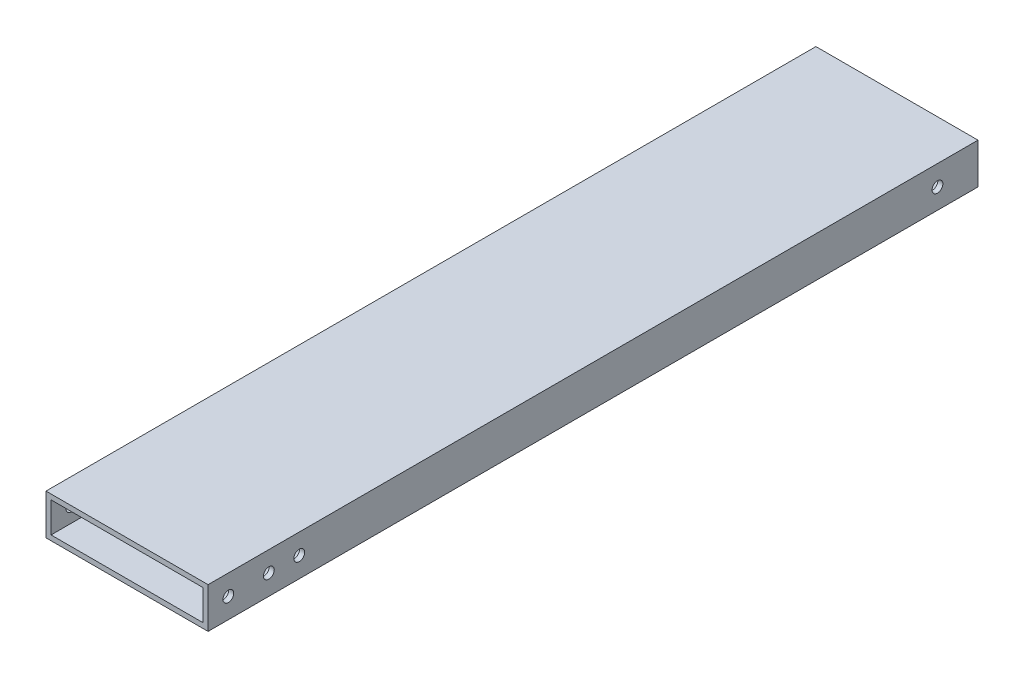
ISO-10303-21;
HEADER;
FILE_DESCRIPTION(('STEP AP214'),'2;1');
FILE_NAME('part.step','',(''),(''),'','','');
FILE_SCHEMA(('AUTOMOTIVE_DESIGN { 1 0 10303 214 1 1 1 1 }'));
ENDSEC;
DATA;
#1=APPLICATION_CONTEXT('core data for automotive mechanical design processes');
#2=APPLICATION_PROTOCOL_DEFINITION('international standard','automotive_design',2000,#1);
#3=PRODUCT_CONTEXT('',#1,'mechanical');
#4=PRODUCT('Part','Part','',(#3));
#5=PRODUCT_RELATED_PRODUCT_CATEGORY('part','',(#4));
#6=PRODUCT_DEFINITION_FORMATION('','',#4);
#7=PRODUCT_DEFINITION_CONTEXT('part definition',#1,'design');
#8=PRODUCT_DEFINITION('design','',#6,#7);
#9=PRODUCT_DEFINITION_SHAPE('','',#8);
#10=(LENGTH_UNIT() NAMED_UNIT(*) SI_UNIT(.MILLI.,.METRE.));
#11=(NAMED_UNIT(*) PLANE_ANGLE_UNIT() SI_UNIT($,.RADIAN.));
#12=(NAMED_UNIT(*) SI_UNIT($,.STERADIAN.) SOLID_ANGLE_UNIT());
#13=UNCERTAINTY_MEASURE_WITH_UNIT(LENGTH_MEASURE(1.E-05),#10,'distance_accuracy_value','');
#14=(GEOMETRIC_REPRESENTATION_CONTEXT(3) GLOBAL_UNCERTAINTY_ASSIGNED_CONTEXT((#13)) GLOBAL_UNIT_ASSIGNED_CONTEXT((#10,
#11,#12)) REPRESENTATION_CONTEXT('',''));
#15=CARTESIAN_POINT('',(0.,0.,0.));
#16=DIRECTION('',(0.,0.,1.));
#17=DIRECTION('',(1.,0.,0.));
#18=AXIS2_PLACEMENT_3D('',#15,#16,#17);
#19=CARTESIAN_POINT('',(0.,0.,482.6));
#20=DIRECTION('',(0.,0.,-1.));
#21=DIRECTION('',(-1.,0.,0.));
#22=AXIS2_PLACEMENT_3D('',#19,#20,#21);
#23=PLANE('',#22);
#24=DIRECTION('',(0.,-1.,0.));
#25=VECTOR('',#24,1.);
#26=CARTESIAN_POINT('',(-50.8,-12.7,482.6));
#27=LINE('',#26,#25);
#28=CARTESIAN_POINT('',(-50.8,12.7,482.6));
#29=VERTEX_POINT('',#28);
#30=CARTESIAN_POINT('',(-50.8,-12.7,482.6));
#31=VERTEX_POINT('',#30);
#32=EDGE_CURVE('E139',#29,#31,#27,.T.);
#33=ORIENTED_EDGE('',*,*,#32,.T.);
#34=DIRECTION('',(1.,0.,0.));
#35=VECTOR('',#34,1.);
#36=CARTESIAN_POINT('',(-50.8,-12.7,482.6));
#37=LINE('',#36,#35);
#38=CARTESIAN_POINT('',(50.8,-12.7,482.6));
#39=VERTEX_POINT('',#38);
#40=EDGE_CURVE('E142',#31,#39,#37,.T.);
#41=ORIENTED_EDGE('',*,*,#40,.T.);
#42=DIRECTION('',(0.,1.,0.));
#43=VECTOR('',#42,1.);
#44=CARTESIAN_POINT('',(50.8,-12.7,482.6));
#45=LINE('',#44,#43);
#46=CARTESIAN_POINT('',(50.8,12.7,482.6));
#47=VERTEX_POINT('',#46);
#48=EDGE_CURVE('E145',#39,#47,#45,.T.);
#49=ORIENTED_EDGE('',*,*,#48,.T.);
#50=DIRECTION('',(-1.,0.,0.));
#51=VECTOR('',#50,1.);
#52=CARTESIAN_POINT('',(-50.8,12.7,482.6));
#53=LINE('',#52,#51);
#54=EDGE_CURVE('E147',#47,#29,#53,.T.);
#55=ORIENTED_EDGE('',*,*,#54,.T.);
#56=EDGE_LOOP('',(#33,#41,#49,#55));
#57=FACE_BOUND('',#56,.T.);
#58=DIRECTION('',(0.,1.,0.));
#59=VECTOR('',#58,1.);
#60=CARTESIAN_POINT('',(47.625,-9.525,482.6));
#61=LINE('',#60,#59);
#62=CARTESIAN_POINT('',(47.625,-9.525,482.6));
#63=VERTEX_POINT('',#62);
#64=CARTESIAN_POINT('',(47.625,9.525,482.6));
#65=VERTEX_POINT('',#64);
#66=EDGE_CURVE('E101',#63,#65,#61,.T.);
#67=ORIENTED_EDGE('',*,*,#66,.F.);
#68=DIRECTION('',(1.,0.,0.));
#69=VECTOR('',#68,1.);
#70=CARTESIAN_POINT('',(-47.625,-9.525,482.6));
#71=LINE('',#70,#69);
#72=CARTESIAN_POINT('',(-47.625,-9.525,482.6));
#73=VERTEX_POINT('',#72);
#74=EDGE_CURVE('E123',#73,#63,#71,.T.);
#75=ORIENTED_EDGE('',*,*,#74,.F.);
#76=DIRECTION('',(0.,-1.,0.));
#77=VECTOR('',#76,1.);
#78=CARTESIAN_POINT('',(-47.625,-9.525,482.6));
#79=LINE('',#78,#77);
#80=CARTESIAN_POINT('',(-47.625,9.525,482.6));
#81=VERTEX_POINT('',#80);
#82=EDGE_CURVE('E121',#81,#73,#79,.T.);
#83=ORIENTED_EDGE('',*,*,#82,.F.);
#84=DIRECTION('',(-1.,0.,0.));
#85=VECTOR('',#84,1.);
#86=CARTESIAN_POINT('',(-47.625,9.525,482.6));
#87=LINE('',#86,#85);
#88=EDGE_CURVE('E109',#65,#81,#87,.T.);
#89=ORIENTED_EDGE('',*,*,#88,.F.);
#90=EDGE_LOOP('',(#67,#75,#83,#89));
#91=FACE_BOUND('',#90,.T.);
#92=ADVANCED_FACE('F34',(#57,#91),#23,.F.);
#93=CARTESIAN_POINT('',(0.,0.,0.));
#94=DIRECTION('',(0.,0.,-1.));
#95=DIRECTION('',(-1.,0.,0.));
#96=AXIS2_PLACEMENT_3D('',#93,#94,#95);
#97=PLANE('',#96);
#98=DIRECTION('',(0.,-1.,0.));
#99=VECTOR('',#98,1.);
#100=CARTESIAN_POINT('',(-50.8,-12.7,0.));
#101=LINE('',#100,#99);
#102=CARTESIAN_POINT('',(-50.8,12.7,0.));
#103=VERTEX_POINT('',#102);
#104=CARTESIAN_POINT('',(-50.8,-12.7,0.));
#105=VERTEX_POINT('',#104);
#106=EDGE_CURVE('E117',#103,#105,#101,.T.);
#107=ORIENTED_EDGE('',*,*,#106,.F.);
#108=DIRECTION('',(-1.,0.,0.));
#109=VECTOR('',#108,1.);
#110=CARTESIAN_POINT('',(-50.8,12.7,0.));
#111=LINE('',#110,#109);
#112=CARTESIAN_POINT('',(50.8,12.7,0.));
#113=VERTEX_POINT('',#112);
#114=EDGE_CURVE('E143',#113,#103,#111,.T.);
#115=ORIENTED_EDGE('',*,*,#114,.F.);
#116=DIRECTION('',(0.,1.,0.));
#117=VECTOR('',#116,1.);
#118=CARTESIAN_POINT('',(50.8,-12.7,0.));
#119=LINE('',#118,#117);
#120=CARTESIAN_POINT('',(50.8,-12.7,0.));
#121=VERTEX_POINT('',#120);
#122=EDGE_CURVE('E154',#121,#113,#119,.T.);
#123=ORIENTED_EDGE('',*,*,#122,.F.);
#124=DIRECTION('',(1.,0.,0.));
#125=VECTOR('',#124,1.);
#126=CARTESIAN_POINT('',(-50.8,-12.7,0.));
#127=LINE('',#126,#125);
#128=EDGE_CURVE('E152',#105,#121,#127,.T.);
#129=ORIENTED_EDGE('',*,*,#128,.F.);
#130=EDGE_LOOP('',(#107,#115,#123,#129));
#131=FACE_BOUND('',#130,.T.);
#132=DIRECTION('',(1.,0.,0.));
#133=VECTOR('',#132,1.);
#134=CARTESIAN_POINT('',(-47.625,-9.525,0.));
#135=LINE('',#134,#133);
#136=CARTESIAN_POINT('',(-47.625,-9.525,0.));
#137=VERTEX_POINT('',#136);
#138=CARTESIAN_POINT('',(47.625,-9.525,0.));
#139=VERTEX_POINT('',#138);
#140=EDGE_CURVE('E110',#137,#139,#135,.T.);
#141=ORIENTED_EDGE('',*,*,#140,.T.);
#142=DIRECTION('',(0.,1.,0.));
#143=VECTOR('',#142,1.);
#144=CARTESIAN_POINT('',(47.625,-9.525,0.));
#145=LINE('',#144,#143);
#146=CARTESIAN_POINT('',(47.625,9.525,0.));
#147=VERTEX_POINT('',#146);
#148=EDGE_CURVE('E59',#139,#147,#145,.T.);
#149=ORIENTED_EDGE('',*,*,#148,.T.);
#150=DIRECTION('',(-1.,0.,0.));
#151=VECTOR('',#150,1.);
#152=CARTESIAN_POINT('',(-47.625,9.525,0.));
#153=LINE('',#152,#151);
#154=CARTESIAN_POINT('',(-47.625,9.525,0.));
#155=VERTEX_POINT('',#154);
#156=EDGE_CURVE('E116',#147,#155,#153,.T.);
#157=ORIENTED_EDGE('',*,*,#156,.T.);
#158=DIRECTION('',(0.,-1.,0.));
#159=VECTOR('',#158,1.);
#160=CARTESIAN_POINT('',(-47.625,-9.525,0.));
#161=LINE('',#160,#159);
#162=EDGE_CURVE('E131',#155,#137,#161,.T.);
#163=ORIENTED_EDGE('',*,*,#162,.T.);
#164=EDGE_LOOP('',(#141,#149,#157,#163));
#165=FACE_BOUND('',#164,.T.);
#166=ADVANCED_FACE('F224',(#131,#165),#97,.T.);
#167=CARTESIAN_POINT('',(-50.8,-12.7,482.6));
#168=DIRECTION('',(1.,0.,0.));
#169=DIRECTION('',(0.,0.,-1.));
#170=AXIS2_PLACEMENT_3D('',#167,#168,#169);
#171=PLANE('',#170);
#172=CARTESIAN_POINT('',(-50.8,0.,25.4));
#173=DIRECTION('',(1.,0.,0.));
#174=DIRECTION('',(0.,0.,-1.));
#175=AXIS2_PLACEMENT_3D('',#172,#173,#174);
#176=CIRCLE('',#175,3.37819999999999);
#177=CARTESIAN_POINT('',(-50.8,0.,22.0218));
#178=VERTEX_POINT('',#177);
#179=EDGE_CURVE('E292',#178,#178,#176,.T.);
#180=ORIENTED_EDGE('',*,*,#179,.T.);
#181=EDGE_LOOP('',(#180));
#182=FACE_BOUND('',#181,.T.);
#183=CARTESIAN_POINT('',(-50.8,0.,469.9));
#184=DIRECTION('',(1.,0.,0.));
#185=DIRECTION('',(0.,0.,-1.));
#186=AXIS2_PLACEMENT_3D('',#183,#184,#185);
#187=CIRCLE('',#186,3.37819999999999);
#188=CARTESIAN_POINT('',(-50.8,0.,466.5218));
#189=VERTEX_POINT('',#188);
#190=EDGE_CURVE('E175',#189,#189,#187,.T.);
#191=ORIENTED_EDGE('',*,*,#190,.T.);
#192=EDGE_LOOP('',(#191));
#193=FACE_BOUND('',#192,.T.);
#194=CARTESIAN_POINT('',(-50.8,0.,444.5));
#195=DIRECTION('',(1.,0.,0.));
#196=DIRECTION('',(0.,0.,-1.));
#197=AXIS2_PLACEMENT_3D('',#194,#195,#196);
#198=CIRCLE('',#197,3.37819999999999);
#199=CARTESIAN_POINT('',(-50.8,0.,441.1218));
#200=VERTEX_POINT('',#199);
#201=EDGE_CURVE('E171',#200,#200,#198,.T.);
#202=ORIENTED_EDGE('',*,*,#201,.T.);
#203=EDGE_LOOP('',(#202));
#204=FACE_BOUND('',#203,.T.);
#205=CARTESIAN_POINT('',(-50.8,0.,425.45));
#206=DIRECTION('',(1.,0.,0.));
#207=DIRECTION('',(0.,0.,-1.));
#208=AXIS2_PLACEMENT_3D('',#205,#206,#207);
#209=CIRCLE('',#208,3.37819999999999);
#210=CARTESIAN_POINT('',(-50.8,0.,422.0718));
#211=VERTEX_POINT('',#210);
#212=EDGE_CURVE('E167',#211,#211,#209,.T.);
#213=ORIENTED_EDGE('',*,*,#212,.T.);
#214=EDGE_LOOP('',(#213));
#215=FACE_BOUND('',#214,.T.);
#216=ORIENTED_EDGE('',*,*,#106,.T.);
#217=DIRECTION('',(0.,0.,-1.));
#218=VECTOR('',#217,1.);
#219=CARTESIAN_POINT('',(-50.8,-12.7,482.6));
#220=LINE('',#219,#218);
#221=EDGE_CURVE('E11',#31,#105,#220,.T.);
#222=ORIENTED_EDGE('',*,*,#221,.F.);
#223=ORIENTED_EDGE('',*,*,#32,.F.);
#224=DIRECTION('',(0.,0.,-1.));
#225=VECTOR('',#224,1.);
#226=CARTESIAN_POINT('',(-50.8,12.7,482.6));
#227=LINE('',#226,#225);
#228=EDGE_CURVE('E149',#29,#103,#227,.T.);
#229=ORIENTED_EDGE('',*,*,#228,.T.);
#230=EDGE_LOOP('',(#216,#222,#223,#229));
#231=FACE_BOUND('',#230,.T.);
#232=ADVANCED_FACE('F36',(#182,#193,#204,#215,#231),#171,.F.);
#233=CARTESIAN_POINT('',(-50.8,-12.7,482.6));
#234=DIRECTION('',(0.,1.,0.));
#235=DIRECTION('',(0.,0.,1.));
#236=AXIS2_PLACEMENT_3D('',#233,#234,#235);
#237=PLANE('',#236);
#238=ORIENTED_EDGE('',*,*,#128,.T.);
#239=DIRECTION('',(0.,0.,-1.));
#240=VECTOR('',#239,1.);
#241=CARTESIAN_POINT('',(50.8,-12.7,482.6));
#242=LINE('',#241,#240);
#243=EDGE_CURVE('E43',#39,#121,#242,.T.);
#244=ORIENTED_EDGE('',*,*,#243,.F.);
#245=ORIENTED_EDGE('',*,*,#40,.F.);
#246=ORIENTED_EDGE('',*,*,#221,.T.);
#247=EDGE_LOOP('',(#238,#244,#245,#246));
#248=FACE_BOUND('',#247,.T.);
#249=ADVANCED_FACE('F233',(#248),#237,.F.);
#250=CARTESIAN_POINT('',(50.8,-12.7,482.6));
#251=DIRECTION('',(-1.,0.,0.));
#252=DIRECTION('',(0.,0.,1.));
#253=AXIS2_PLACEMENT_3D('',#250,#251,#252);
#254=PLANE('',#253);
#255=CARTESIAN_POINT('',(50.8,0.,25.4));
#256=DIRECTION('',(1.,0.,0.));
#257=DIRECTION('',(0.,0.,-1.));
#258=AXIS2_PLACEMENT_3D('',#255,#256,#257);
#259=CIRCLE('',#258,3.37819999999999);
#260=CARTESIAN_POINT('',(50.8,0.,22.0218));
#261=VERTEX_POINT('',#260);
#262=EDGE_CURVE('E291',#261,#261,#259,.T.);
#263=ORIENTED_EDGE('',*,*,#262,.F.);
#264=EDGE_LOOP('',(#263));
#265=FACE_BOUND('',#264,.T.);
#266=CARTESIAN_POINT('',(50.8,0.,469.9));
#267=DIRECTION('',(1.,0.,0.));
#268=DIRECTION('',(0.,0.,-1.));
#269=AXIS2_PLACEMENT_3D('',#266,#267,#268);
#270=CIRCLE('',#269,3.37819999999999);
#271=CARTESIAN_POINT('',(50.8,0.,466.5218));
#272=VERTEX_POINT('',#271);
#273=EDGE_CURVE('E182',#272,#272,#270,.T.);
#274=ORIENTED_EDGE('',*,*,#273,.F.);
#275=EDGE_LOOP('',(#274));
#276=FACE_BOUND('',#275,.T.);
#277=CARTESIAN_POINT('',(50.8,0.,444.5));
#278=DIRECTION('',(1.,0.,0.));
#279=DIRECTION('',(0.,0.,-1.));
#280=AXIS2_PLACEMENT_3D('',#277,#278,#279);
#281=CIRCLE('',#280,3.37819999999999);
#282=CARTESIAN_POINT('',(50.8,0.,441.1218));
#283=VERTEX_POINT('',#282);
#284=EDGE_CURVE('E179',#283,#283,#281,.T.);
#285=ORIENTED_EDGE('',*,*,#284,.F.);
#286=EDGE_LOOP('',(#285));
#287=FACE_BOUND('',#286,.T.);
#288=CARTESIAN_POINT('',(50.8,0.,425.45));
#289=DIRECTION('',(1.,0.,0.));
#290=DIRECTION('',(0.,0.,-1.));
#291=AXIS2_PLACEMENT_3D('',#288,#289,#290);
#292=CIRCLE('',#291,3.37819999999999);
#293=CARTESIAN_POINT('',(50.8,0.,422.0718));
#294=VERTEX_POINT('',#293);
#295=EDGE_CURVE('E197',#294,#294,#292,.T.);
#296=ORIENTED_EDGE('',*,*,#295,.F.);
#297=EDGE_LOOP('',(#296));
#298=FACE_BOUND('',#297,.T.);
#299=ORIENTED_EDGE('',*,*,#122,.T.);
#300=DIRECTION('',(0.,0.,-1.));
#301=VECTOR('',#300,1.);
#302=CARTESIAN_POINT('',(50.8,12.7,482.6));
#303=LINE('',#302,#301);
#304=EDGE_CURVE('E159',#47,#113,#303,.T.);
#305=ORIENTED_EDGE('',*,*,#304,.F.);
#306=ORIENTED_EDGE('',*,*,#48,.F.);
#307=ORIENTED_EDGE('',*,*,#243,.T.);
#308=EDGE_LOOP('',(#299,#305,#306,#307));
#309=FACE_BOUND('',#308,.T.);
#310=ADVANCED_FACE('F217',(#265,#276,#287,#298,#309),#254,.F.);
#311=CARTESIAN_POINT('',(-50.8,12.7,482.6));
#312=DIRECTION('',(0.,-1.,0.));
#313=DIRECTION('',(0.,0.,-1.));
#314=AXIS2_PLACEMENT_3D('',#311,#312,#313);
#315=PLANE('',#314);
#316=ORIENTED_EDGE('',*,*,#114,.T.);
#317=ORIENTED_EDGE('',*,*,#228,.F.);
#318=ORIENTED_EDGE('',*,*,#54,.F.);
#319=ORIENTED_EDGE('',*,*,#304,.T.);
#320=EDGE_LOOP('',(#316,#317,#318,#319));
#321=FACE_BOUND('',#320,.T.);
#322=ADVANCED_FACE('F208',(#321),#315,.F.);
#323=CARTESIAN_POINT('',(47.625,-9.525,482.6));
#324=DIRECTION('',(-1.,0.,0.));
#325=DIRECTION('',(0.,0.,1.));
#326=AXIS2_PLACEMENT_3D('',#323,#324,#325);
#327=PLANE('',#326);
#328=CARTESIAN_POINT('',(47.625,0.,25.4));
#329=DIRECTION('',(-1.,0.,0.));
#330=DIRECTION('',(0.,0.,1.));
#331=AXIS2_PLACEMENT_3D('',#328,#329,#330);
#332=CIRCLE('',#331,3.37819999999999);
#333=CARTESIAN_POINT('',(47.625,0.,28.7782));
#334=VERTEX_POINT('',#333);
#335=EDGE_CURVE('E38',#334,#334,#332,.T.);
#336=ORIENTED_EDGE('',*,*,#335,.F.);
#337=EDGE_LOOP('',(#336));
#338=FACE_BOUND('',#337,.T.);
#339=CARTESIAN_POINT('',(47.625,0.,469.9));
#340=DIRECTION('',(-1.,0.,0.));
#341=DIRECTION('',(0.,0.,1.));
#342=AXIS2_PLACEMENT_3D('',#339,#340,#341);
#343=CIRCLE('',#342,3.37819999999999);
#344=CARTESIAN_POINT('',(47.625,0.,473.2782));
#345=VERTEX_POINT('',#344);
#346=EDGE_CURVE('E174',#345,#345,#343,.T.);
#347=ORIENTED_EDGE('',*,*,#346,.F.);
#348=EDGE_LOOP('',(#347));
#349=FACE_BOUND('',#348,.T.);
#350=CARTESIAN_POINT('',(47.625,0.,444.5));
#351=DIRECTION('',(-1.,0.,0.));
#352=DIRECTION('',(0.,0.,1.));
#353=AXIS2_PLACEMENT_3D('',#350,#351,#352);
#354=CIRCLE('',#353,3.37819999999999);
#355=CARTESIAN_POINT('',(47.625,0.,447.8782));
#356=VERTEX_POINT('',#355);
#357=EDGE_CURVE('E170',#356,#356,#354,.T.);
#358=ORIENTED_EDGE('',*,*,#357,.F.);
#359=EDGE_LOOP('',(#358));
#360=FACE_BOUND('',#359,.T.);
#361=CARTESIAN_POINT('',(47.625,0.,425.45));
#362=DIRECTION('',(-1.,0.,0.));
#363=DIRECTION('',(0.,0.,1.));
#364=AXIS2_PLACEMENT_3D('',#361,#362,#363);
#365=CIRCLE('',#364,3.37819999999999);
#366=CARTESIAN_POINT('',(47.625,0.,428.8282));
#367=VERTEX_POINT('',#366);
#368=EDGE_CURVE('E129',#367,#367,#365,.T.);
#369=ORIENTED_EDGE('',*,*,#368,.F.);
#370=EDGE_LOOP('',(#369));
#371=FACE_BOUND('',#370,.T.);
#372=ORIENTED_EDGE('',*,*,#148,.F.);
#373=DIRECTION('',(0.,0.,-1.));
#374=VECTOR('',#373,1.);
#375=CARTESIAN_POINT('',(47.625,-9.525,482.6));
#376=LINE('',#375,#374);
#377=EDGE_CURVE('E105',#63,#139,#376,.T.);
#378=ORIENTED_EDGE('',*,*,#377,.F.);
#379=ORIENTED_EDGE('',*,*,#66,.T.);
#380=DIRECTION('',(0.,0.,-1.));
#381=VECTOR('',#380,1.);
#382=CARTESIAN_POINT('',(47.625,9.525,482.6));
#383=LINE('',#382,#381);
#384=EDGE_CURVE('E104',#65,#147,#383,.T.);
#385=ORIENTED_EDGE('',*,*,#384,.T.);
#386=EDGE_LOOP('',(#372,#378,#379,#385));
#387=FACE_BOUND('',#386,.T.);
#388=ADVANCED_FACE('F103',(#338,#349,#360,#371,#387),#327,.T.);
#389=CARTESIAN_POINT('',(-47.625,9.525,482.6));
#390=DIRECTION('',(0.,-1.,0.));
#391=DIRECTION('',(0.,0.,-1.));
#392=AXIS2_PLACEMENT_3D('',#389,#390,#391);
#393=PLANE('',#392);
#394=ORIENTED_EDGE('',*,*,#156,.F.);
#395=ORIENTED_EDGE('',*,*,#384,.F.);
#396=ORIENTED_EDGE('',*,*,#88,.T.);
#397=DIRECTION('',(0.,0.,-1.));
#398=VECTOR('',#397,1.);
#399=CARTESIAN_POINT('',(-47.625,9.525,482.6));
#400=LINE('',#399,#398);
#401=EDGE_CURVE('E118',#81,#155,#400,.T.);
#402=ORIENTED_EDGE('',*,*,#401,.T.);
#403=EDGE_LOOP('',(#394,#395,#396,#402));
#404=FACE_BOUND('',#403,.T.);
#405=ADVANCED_FACE('F113',(#404),#393,.T.);
#406=CARTESIAN_POINT('',(-47.625,-9.525,482.6));
#407=DIRECTION('',(1.,0.,0.));
#408=DIRECTION('',(0.,0.,-1.));
#409=AXIS2_PLACEMENT_3D('',#406,#407,#408);
#410=PLANE('',#409);
#411=CARTESIAN_POINT('',(-47.625,0.,25.4));
#412=DIRECTION('',(1.,0.,0.));
#413=DIRECTION('',(0.,0.,-1.));
#414=AXIS2_PLACEMENT_3D('',#411,#412,#413);
#415=CIRCLE('',#414,3.37819999999999);
#416=CARTESIAN_POINT('',(-47.625,0.,22.0218));
#417=VERTEX_POINT('',#416);
#418=EDGE_CURVE('E187',#417,#417,#415,.T.);
#419=ORIENTED_EDGE('',*,*,#418,.F.);
#420=EDGE_LOOP('',(#419));
#421=FACE_BOUND('',#420,.T.);
#422=CARTESIAN_POINT('',(-47.625,0.,469.9));
#423=DIRECTION('',(1.,0.,0.));
#424=DIRECTION('',(0.,0.,-1.));
#425=AXIS2_PLACEMENT_3D('',#422,#423,#424);
#426=CIRCLE('',#425,3.37819999999999);
#427=CARTESIAN_POINT('',(-47.625,0.,466.5218));
#428=VERTEX_POINT('',#427);
#429=EDGE_CURVE('E172',#428,#428,#426,.T.);
#430=ORIENTED_EDGE('',*,*,#429,.F.);
#431=EDGE_LOOP('',(#430));
#432=FACE_BOUND('',#431,.T.);
#433=CARTESIAN_POINT('',(-47.625,0.,444.5));
#434=DIRECTION('',(1.,0.,0.));
#435=DIRECTION('',(0.,0.,-1.));
#436=AXIS2_PLACEMENT_3D('',#433,#434,#435);
#437=CIRCLE('',#436,3.37819999999999);
#438=CARTESIAN_POINT('',(-47.625,0.,441.1218));
#439=VERTEX_POINT('',#438);
#440=EDGE_CURVE('E168',#439,#439,#437,.T.);
#441=ORIENTED_EDGE('',*,*,#440,.F.);
#442=EDGE_LOOP('',(#441));
#443=FACE_BOUND('',#442,.T.);
#444=CARTESIAN_POINT('',(-47.625,0.,425.45));
#445=DIRECTION('',(1.,0.,0.));
#446=DIRECTION('',(0.,0.,-1.));
#447=AXIS2_PLACEMENT_3D('',#444,#445,#446);
#448=CIRCLE('',#447,3.37819999999999);
#449=CARTESIAN_POINT('',(-47.625,0.,422.0718));
#450=VERTEX_POINT('',#449);
#451=EDGE_CURVE('E164',#450,#450,#448,.T.);
#452=ORIENTED_EDGE('',*,*,#451,.F.);
#453=EDGE_LOOP('',(#452));
#454=FACE_BOUND('',#453,.T.);
#455=ORIENTED_EDGE('',*,*,#162,.F.);
#456=ORIENTED_EDGE('',*,*,#401,.F.);
#457=ORIENTED_EDGE('',*,*,#82,.T.);
#458=DIRECTION('',(0.,0.,-1.));
#459=VECTOR('',#458,1.);
#460=CARTESIAN_POINT('',(-47.625,-9.525,482.6));
#461=LINE('',#460,#459);
#462=EDGE_CURVE('E51',#73,#137,#461,.T.);
#463=ORIENTED_EDGE('',*,*,#462,.T.);
#464=EDGE_LOOP('',(#455,#456,#457,#463));
#465=FACE_BOUND('',#464,.T.);
#466=ADVANCED_FACE('F215',(#421,#432,#443,#454,#465),#410,.T.);
#467=CARTESIAN_POINT('',(-47.625,-9.525,482.6));
#468=DIRECTION('',(0.,1.,0.));
#469=DIRECTION('',(0.,0.,1.));
#470=AXIS2_PLACEMENT_3D('',#467,#468,#469);
#471=PLANE('',#470);
#472=ORIENTED_EDGE('',*,*,#140,.F.);
#473=ORIENTED_EDGE('',*,*,#462,.F.);
#474=ORIENTED_EDGE('',*,*,#74,.T.);
#475=ORIENTED_EDGE('',*,*,#377,.T.);
#476=EDGE_LOOP('',(#472,#473,#474,#475));
#477=FACE_BOUND('',#476,.T.);
#478=ADVANCED_FACE('F255',(#477),#471,.T.);
#479=CARTESIAN_POINT('',(50.8,0.,425.45));
#480=DIRECTION('',(1.,0.,0.));
#481=DIRECTION('',(0.,0.,-1.));
#482=AXIS2_PLACEMENT_3D('',#479,#480,#481);
#483=CYLINDRICAL_SURFACE('',#482,3.37819999999999);
#484=ORIENTED_EDGE('',*,*,#451,.T.);
#485=EDGE_LOOP('',(#484));
#486=FACE_BOUND('',#485,.T.);
#487=ORIENTED_EDGE('',*,*,#212,.F.);
#488=EDGE_LOOP('',(#487));
#489=FACE_BOUND('',#488,.T.);
#490=ADVANCED_FACE('F257',(#486,#489),#483,.F.);
#491=ORIENTED_EDGE('',*,*,#368,.T.);
#492=EDGE_LOOP('',(#491));
#493=FACE_BOUND('',#492,.T.);
#494=ORIENTED_EDGE('',*,*,#295,.T.);
#495=EDGE_LOOP('',(#494));
#496=FACE_BOUND('',#495,.T.);
#497=ADVANCED_FACE('F204',(#493,#496),#483,.F.);
#498=CARTESIAN_POINT('',(50.8,0.,444.5));
#499=DIRECTION('',(1.,0.,0.));
#500=DIRECTION('',(0.,0.,-1.));
#501=AXIS2_PLACEMENT_3D('',#498,#499,#500);
#502=CYLINDRICAL_SURFACE('',#501,3.37819999999999);
#503=ORIENTED_EDGE('',*,*,#440,.T.);
#504=EDGE_LOOP('',(#503));
#505=FACE_BOUND('',#504,.T.);
#506=ORIENTED_EDGE('',*,*,#201,.F.);
#507=EDGE_LOOP('',(#506));
#508=FACE_BOUND('',#507,.T.);
#509=ADVANCED_FACE('F268',(#505,#508),#502,.F.);
#510=ORIENTED_EDGE('',*,*,#357,.T.);
#511=EDGE_LOOP('',(#510));
#512=FACE_BOUND('',#511,.T.);
#513=ORIENTED_EDGE('',*,*,#284,.T.);
#514=EDGE_LOOP('',(#513));
#515=FACE_BOUND('',#514,.T.);
#516=ADVANCED_FACE('F271',(#512,#515),#502,.F.);
#517=CARTESIAN_POINT('',(50.8,0.,469.9));
#518=DIRECTION('',(1.,0.,0.));
#519=DIRECTION('',(0.,0.,-1.));
#520=AXIS2_PLACEMENT_3D('',#517,#518,#519);
#521=CYLINDRICAL_SURFACE('',#520,3.37819999999999);
#522=ORIENTED_EDGE('',*,*,#429,.T.);
#523=EDGE_LOOP('',(#522));
#524=FACE_BOUND('',#523,.T.);
#525=ORIENTED_EDGE('',*,*,#190,.F.);
#526=EDGE_LOOP('',(#525));
#527=FACE_BOUND('',#526,.T.);
#528=ADVANCED_FACE('F273',(#524,#527),#521,.F.);
#529=ORIENTED_EDGE('',*,*,#346,.T.);
#530=EDGE_LOOP('',(#529));
#531=FACE_BOUND('',#530,.T.);
#532=ORIENTED_EDGE('',*,*,#273,.T.);
#533=EDGE_LOOP('',(#532));
#534=FACE_BOUND('',#533,.T.);
#535=ADVANCED_FACE('F276',(#531,#534),#521,.F.);
#536=CARTESIAN_POINT('',(50.8,0.,25.4));
#537=DIRECTION('',(1.,0.,0.));
#538=DIRECTION('',(0.,0.,-1.));
#539=AXIS2_PLACEMENT_3D('',#536,#537,#538);
#540=CYLINDRICAL_SURFACE('',#539,3.37819999999999);
#541=ORIENTED_EDGE('',*,*,#335,.T.);
#542=EDGE_LOOP('',(#541));
#543=FACE_BOUND('',#542,.T.);
#544=ORIENTED_EDGE('',*,*,#262,.T.);
#545=EDGE_LOOP('',(#544));
#546=FACE_BOUND('',#545,.T.);
#547=ADVANCED_FACE('F277',(#543,#546),#540,.F.);
#548=ORIENTED_EDGE('',*,*,#418,.T.);
#549=EDGE_LOOP('',(#548));
#550=FACE_BOUND('',#549,.T.);
#551=ORIENTED_EDGE('',*,*,#179,.F.);
#552=EDGE_LOOP('',(#551));
#553=FACE_BOUND('',#552,.T.);
#554=ADVANCED_FACE('F279',(#550,#553),#540,.F.);
#555=CLOSED_SHELL('',(#92,#166,#232,#249,#310,#322,#388,#405,#466,#478,#490,#497,#509,#516,#528,
#535,#547,#554));
#556=MANIFOLD_SOLID_BREP('B2',#555);
#557=ADVANCED_BREP_SHAPE_REPRESENTATION('',(#18,#556),#14);
#558=SHAPE_DEFINITION_REPRESENTATION(#9,#557);
ENDSEC;
END-ISO-10303-21;
